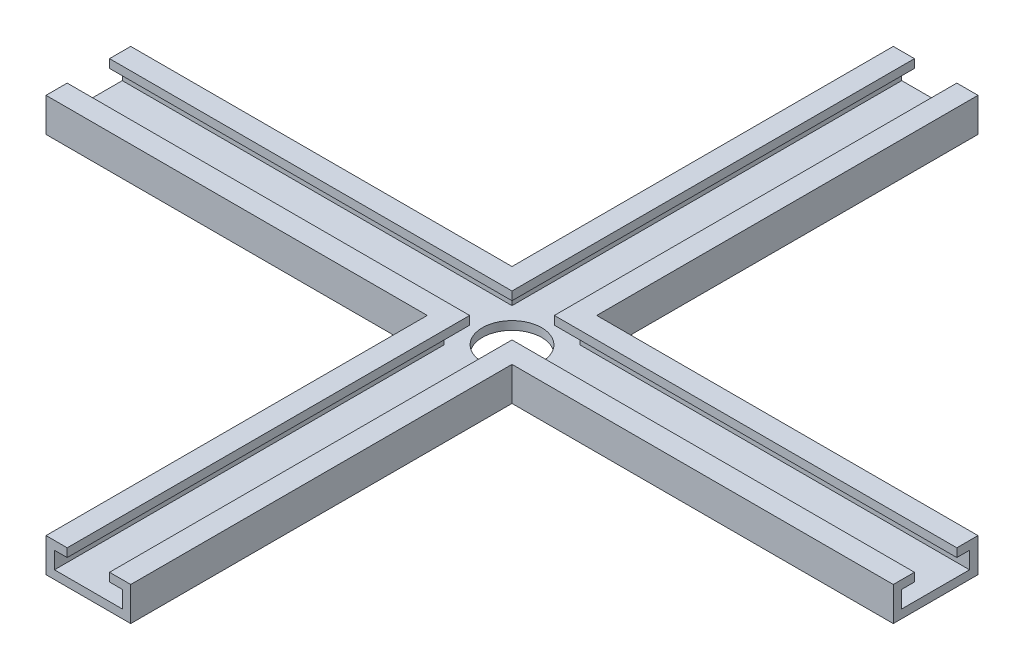
ISO-10303-21;
HEADER;
FILE_DESCRIPTION(('STEP AP214'),'2;1');
FILE_NAME('part.step','',(''),(''),'','','');
FILE_SCHEMA(('AUTOMOTIVE_DESIGN { 1 0 10303 214 1 1 1 1 }'));
ENDSEC;
DATA;
#1=APPLICATION_CONTEXT('core data for automotive mechanical design processes');
#2=APPLICATION_PROTOCOL_DEFINITION('international standard','automotive_design',2000,#1);
#3=PRODUCT_CONTEXT('',#1,'mechanical');
#4=PRODUCT('Part','Part','',(#3));
#5=PRODUCT_RELATED_PRODUCT_CATEGORY('part','',(#4));
#6=PRODUCT_DEFINITION_FORMATION('','',#4);
#7=PRODUCT_DEFINITION_CONTEXT('part definition',#1,'design');
#8=PRODUCT_DEFINITION('design','',#6,#7);
#9=PRODUCT_DEFINITION_SHAPE('','',#8);
#10=(LENGTH_UNIT() NAMED_UNIT(*) SI_UNIT(.MILLI.,.METRE.));
#11=(NAMED_UNIT(*) PLANE_ANGLE_UNIT() SI_UNIT($,.RADIAN.));
#12=(NAMED_UNIT(*) SI_UNIT($,.STERADIAN.) SOLID_ANGLE_UNIT());
#13=UNCERTAINTY_MEASURE_WITH_UNIT(LENGTH_MEASURE(1.E-05),#10,'distance_accuracy_value','');
#14=(GEOMETRIC_REPRESENTATION_CONTEXT(3) GLOBAL_UNCERTAINTY_ASSIGNED_CONTEXT((#13)) GLOBAL_UNIT_ASSIGNED_CONTEXT((#10,
#11,#12)) REPRESENTATION_CONTEXT('',''));
#15=CARTESIAN_POINT('',(0.,0.,0.));
#16=DIRECTION('',(0.,0.,1.));
#17=DIRECTION('',(1.,0.,0.));
#18=AXIS2_PLACEMENT_3D('',#15,#16,#17);
#19=CARTESIAN_POINT('',(-10.,8.,200.));
#20=DIRECTION('',(0.,-1.,0.));
#21=DIRECTION('',(0.,0.,-1.));
#22=AXIS2_PLACEMENT_3D('',#19,#20,#21);
#23=PLANE('',#22);
#24=DIRECTION('',(0.,0.,-1.));
#25=VECTOR('',#24,1.);
#26=CARTESIAN_POINT('',(-5.,8.,200.));
#27=LINE('',#26,#25);
#28=CARTESIAN_POINT('',(-5.,8.,200.));
#29=VERTEX_POINT('',#28);
#30=CARTESIAN_POINT('',(-5.,8.,105.));
#31=VERTEX_POINT('',#30);
#32=EDGE_CURVE('E397',#29,#31,#27,.T.);
#33=ORIENTED_EDGE('',*,*,#32,.T.);
#34=DIRECTION('',(-1.,0.,0.));
#35=VECTOR('',#34,1.);
#36=CARTESIAN_POINT('',(100.,8.,105.));
#37=LINE('',#36,#35);
#38=CARTESIAN_POINT('',(-100.,8.,105.));
#39=VERTEX_POINT('',#38);
#40=EDGE_CURVE('E432',#31,#39,#37,.T.);
#41=ORIENTED_EDGE('',*,*,#40,.T.);
#42=DIRECTION('',(0.,0.,1.));
#43=VECTOR('',#42,1.);
#44=CARTESIAN_POINT('',(-100.,8.,110.));
#45=LINE('',#44,#43);
#46=CARTESIAN_POINT('',(-100.,8.,110.));
#47=VERTEX_POINT('',#46);
#48=EDGE_CURVE('E482',#39,#47,#45,.T.);
#49=ORIENTED_EDGE('',*,*,#48,.T.);
#50=DIRECTION('',(-1.,0.,0.));
#51=VECTOR('',#50,1.);
#52=CARTESIAN_POINT('',(100.,8.,110.));
#53=LINE('',#52,#51);
#54=CARTESIAN_POINT('',(-10.,8.,110.));
#55=VERTEX_POINT('',#54);
#56=EDGE_CURVE('E517',#55,#47,#53,.T.);
#57=ORIENTED_EDGE('',*,*,#56,.F.);
#58=DIRECTION('',(0.,0.,-1.));
#59=VECTOR('',#58,1.);
#60=CARTESIAN_POINT('',(-10.,8.,200.));
#61=LINE('',#60,#59);
#62=CARTESIAN_POINT('',(-10.,8.,200.));
#63=VERTEX_POINT('',#62);
#64=EDGE_CURVE('E394',#63,#55,#61,.T.);
#65=ORIENTED_EDGE('',*,*,#64,.F.);
#66=DIRECTION('',(-1.,0.,0.));
#67=VECTOR('',#66,1.);
#68=CARTESIAN_POINT('',(-10.,8.,200.));
#69=LINE('',#68,#67);
#70=EDGE_CURVE('E349',#29,#63,#69,.T.);
#71=ORIENTED_EDGE('',*,*,#70,.F.);
#72=EDGE_LOOP('',(#33,#41,#49,#57,#65,#71));
#73=FACE_BOUND('',#72,.T.);
#74=ADVANCED_FACE('F31',(#73),#23,.F.);
#75=DIRECTION('',(-1.,0.,0.));
#76=VECTOR('',#75,1.);
#77=CARTESIAN_POINT('',(100.,8.,95.));
#78=LINE('',#77,#76);
#79=CARTESIAN_POINT('',(-5.,8.,95.));
#80=VERTEX_POINT('',#79);
#81=CARTESIAN_POINT('',(-100.,8.,95.));
#82=VERTEX_POINT('',#81);
#83=EDGE_CURVE('E303',#80,#82,#78,.T.);
#84=ORIENTED_EDGE('',*,*,#83,.F.);
#85=CARTESIAN_POINT('',(-5.,8.,0.));
#86=VERTEX_POINT('',#85);
#87=EDGE_CURVE('E396',#80,#86,#27,.T.);
#88=ORIENTED_EDGE('',*,*,#87,.T.);
#89=DIRECTION('',(-1.,0.,0.));
#90=VECTOR('',#89,1.);
#91=CARTESIAN_POINT('',(-10.,8.,0.));
#92=LINE('',#91,#90);
#93=CARTESIAN_POINT('',(-10.,8.,0.));
#94=VERTEX_POINT('',#93);
#95=EDGE_CURVE('E378',#86,#94,#92,.T.);
#96=ORIENTED_EDGE('',*,*,#95,.T.);
#97=CARTESIAN_POINT('',(-10.,8.,90.));
#98=VERTEX_POINT('',#97);
#99=EDGE_CURVE('E393',#98,#94,#61,.T.);
#100=ORIENTED_EDGE('',*,*,#99,.F.);
#101=DIRECTION('',(-1.,0.,0.));
#102=VECTOR('',#101,1.);
#103=CARTESIAN_POINT('',(100.,8.,90.));
#104=LINE('',#103,#102);
#105=CARTESIAN_POINT('',(-100.,8.,90.));
#106=VERTEX_POINT('',#105);
#107=EDGE_CURVE('E307',#98,#106,#104,.T.);
#108=ORIENTED_EDGE('',*,*,#107,.T.);
#109=DIRECTION('',(0.,0.,1.));
#110=VECTOR('',#109,1.);
#111=CARTESIAN_POINT('',(-100.,8.,90.));
#112=LINE('',#111,#110);
#113=EDGE_CURVE('E527',#106,#82,#112,.T.);
#114=ORIENTED_EDGE('',*,*,#113,.T.);
#115=EDGE_LOOP('',(#84,#88,#96,#100,#108,#114));
#116=FACE_BOUND('',#115,.T.);
#117=ADVANCED_FACE('F552',(#116),#23,.F.);
#118=CARTESIAN_POINT('',(100.,6.,95.));
#119=DIRECTION('',(0.,0.,-1.));
#120=DIRECTION('',(-1.,0.,0.));
#121=AXIS2_PLACEMENT_3D('',#118,#119,#120);
#122=PLANE('',#121);
#123=DIRECTION('',(-1.,0.,0.));
#124=VECTOR('',#123,1.);
#125=CARTESIAN_POINT('',(100.,6.,95.));
#126=LINE('',#125,#124);
#127=CARTESIAN_POINT('',(-5.,6.,95.));
#128=VERTEX_POINT('',#127);
#129=CARTESIAN_POINT('',(-100.,6.,95.));
#130=VERTEX_POINT('',#129);
#131=EDGE_CURVE('E294',#128,#130,#126,.T.);
#132=ORIENTED_EDGE('',*,*,#131,.F.);
#133=DIRECTION('',(0.,1.,0.));
#134=VECTOR('',#133,1.);
#135=CARTESIAN_POINT('',(-5.,6.,95.));
#136=LINE('',#135,#134);
#137=EDGE_CURVE('E550',#128,#80,#136,.T.);
#138=ORIENTED_EDGE('',*,*,#137,.T.);
#139=ORIENTED_EDGE('',*,*,#83,.T.);
#140=DIRECTION('',(0.,-1.,0.));
#141=VECTOR('',#140,1.);
#142=CARTESIAN_POINT('',(-100.,6.,95.));
#143=LINE('',#142,#141);
#144=EDGE_CURVE('E530',#82,#130,#143,.T.);
#145=ORIENTED_EDGE('',*,*,#144,.T.);
#146=EDGE_LOOP('',(#132,#138,#139,#145));
#147=FACE_BOUND('',#146,.T.);
#148=ADVANCED_FACE('F548',(#147),#122,.F.);
#149=CARTESIAN_POINT('',(100.,2.,92.));
#150=DIRECTION('',(0.,0.,-1.));
#151=DIRECTION('',(-1.,0.,0.));
#152=AXIS2_PLACEMENT_3D('',#149,#150,#151);
#153=PLANE('',#152);
#154=DIRECTION('',(-1.,0.,0.));
#155=VECTOR('',#154,1.);
#156=CARTESIAN_POINT('',(100.,2.,92.));
#157=LINE('',#156,#155);
#158=CARTESIAN_POINT('',(-7.99999999999999,2.,92.));
#159=VERTEX_POINT('',#158);
#160=CARTESIAN_POINT('',(-100.,2.,92.));
#161=VERTEX_POINT('',#160);
#162=EDGE_CURVE('E445',#159,#161,#157,.T.);
#163=ORIENTED_EDGE('',*,*,#162,.F.);
#164=DIRECTION('',(0.,1.,0.));
#165=VECTOR('',#164,1.);
#166=CARTESIAN_POINT('',(-8.00000000000001,2.,92.));
#167=LINE('',#166,#165);
#168=CARTESIAN_POINT('',(-8.,6.,92.));
#169=VERTEX_POINT('',#168);
#170=EDGE_CURVE('E497',#159,#169,#167,.T.);
#171=ORIENTED_EDGE('',*,*,#170,.T.);
#172=DIRECTION('',(-1.,0.,0.));
#173=VECTOR('',#172,1.);
#174=CARTESIAN_POINT('',(100.,6.,92.));
#175=LINE('',#174,#173);
#176=CARTESIAN_POINT('',(-100.,6.,92.));
#177=VERTEX_POINT('',#176);
#178=EDGE_CURVE('E295',#169,#177,#175,.T.);
#179=ORIENTED_EDGE('',*,*,#178,.T.);
#180=DIRECTION('',(0.,-1.,0.));
#181=VECTOR('',#180,1.);
#182=CARTESIAN_POINT('',(-100.,2.,92.));
#183=LINE('',#182,#181);
#184=EDGE_CURVE('E469',#177,#161,#183,.T.);
#185=ORIENTED_EDGE('',*,*,#184,.T.);
#186=EDGE_LOOP('',(#163,#171,#179,#185));
#187=FACE_BOUND('',#186,.T.);
#188=ADVANCED_FACE('F536',(#187),#153,.F.);
#189=CARTESIAN_POINT('',(100.,2.,108.));
#190=DIRECTION('',(0.,0.,1.));
#191=DIRECTION('',(1.,0.,0.));
#192=AXIS2_PLACEMENT_3D('',#189,#190,#191);
#193=PLANE('',#192);
#194=DIRECTION('',(-1.,0.,0.));
#195=VECTOR('',#194,1.);
#196=CARTESIAN_POINT('',(100.,6.,108.));
#197=LINE('',#196,#195);
#198=CARTESIAN_POINT('',(-8.,6.,108.));
#199=VERTEX_POINT('',#198);
#200=CARTESIAN_POINT('',(-100.,6.,108.));
#201=VERTEX_POINT('',#200);
#202=EDGE_CURVE('E439',#199,#201,#197,.T.);
#203=ORIENTED_EDGE('',*,*,#202,.F.);
#204=DIRECTION('',(0.,-1.,0.));
#205=VECTOR('',#204,1.);
#206=CARTESIAN_POINT('',(-8.00000000000001,2.,108.));
#207=LINE('',#206,#205);
#208=CARTESIAN_POINT('',(-8.,2.,108.));
#209=VERTEX_POINT('',#208);
#210=EDGE_CURVE('E289',#199,#209,#207,.T.);
#211=ORIENTED_EDGE('',*,*,#210,.T.);
#212=DIRECTION('',(-1.,0.,0.));
#213=VECTOR('',#212,1.);
#214=CARTESIAN_POINT('',(100.,2.,108.));
#215=LINE('',#214,#213);
#216=CARTESIAN_POINT('',(-100.,2.,108.));
#217=VERTEX_POINT('',#216);
#218=EDGE_CURVE('E442',#209,#217,#215,.T.);
#219=ORIENTED_EDGE('',*,*,#218,.T.);
#220=DIRECTION('',(0.,1.,0.));
#221=VECTOR('',#220,1.);
#222=CARTESIAN_POINT('',(-100.,2.,108.));
#223=LINE('',#222,#221);
#224=EDGE_CURVE('E458',#217,#201,#223,.T.);
#225=ORIENTED_EDGE('',*,*,#224,.T.);
#226=EDGE_LOOP('',(#203,#211,#219,#225));
#227=FACE_BOUND('',#226,.T.);
#228=ADVANCED_FACE('F456',(#227),#193,.F.);
#229=CARTESIAN_POINT('',(100.,6.,105.));
#230=DIRECTION('',(0.,0.,1.));
#231=DIRECTION('',(1.,0.,0.));
#232=AXIS2_PLACEMENT_3D('',#229,#230,#231);
#233=PLANE('',#232);
#234=ORIENTED_EDGE('',*,*,#40,.F.);
#235=DIRECTION('',(0.,-1.,0.));
#236=VECTOR('',#235,1.);
#237=CARTESIAN_POINT('',(-5.,6.,105.));
#238=LINE('',#237,#236);
#239=CARTESIAN_POINT('',(-5.,6.,105.));
#240=VERTEX_POINT('',#239);
#241=EDGE_CURVE('E11',#31,#240,#238,.T.);
#242=ORIENTED_EDGE('',*,*,#241,.T.);
#243=DIRECTION('',(-1.,0.,0.));
#244=VECTOR('',#243,1.);
#245=CARTESIAN_POINT('',(100.,6.,105.));
#246=LINE('',#245,#244);
#247=CARTESIAN_POINT('',(-100.,6.,105.));
#248=VERTEX_POINT('',#247);
#249=EDGE_CURVE('E431',#240,#248,#246,.T.);
#250=ORIENTED_EDGE('',*,*,#249,.T.);
#251=DIRECTION('',(0.,1.,0.));
#252=VECTOR('',#251,1.);
#253=CARTESIAN_POINT('',(-100.,6.,105.));
#254=LINE('',#253,#252);
#255=EDGE_CURVE('E477',#248,#39,#254,.T.);
#256=ORIENTED_EDGE('',*,*,#255,.T.);
#257=EDGE_LOOP('',(#234,#242,#250,#256));
#258=FACE_BOUND('',#257,.T.);
#259=ADVANCED_FACE('F570',(#258),#233,.F.);
#260=CARTESIAN_POINT('',(100.,8.,105.));
#261=VERTEX_POINT('',#260);
#262=CARTESIAN_POINT('',(5.,8.,105.));
#263=VERTEX_POINT('',#262);
#264=EDGE_CURVE('E422',#261,#263,#37,.T.);
#265=ORIENTED_EDGE('',*,*,#264,.T.);
#266=DIRECTION('',(0.,0.,-1.));
#267=VECTOR('',#266,1.);
#268=CARTESIAN_POINT('',(5.,8.,200.));
#269=LINE('',#268,#267);
#270=CARTESIAN_POINT('',(5.,8.,200.));
#271=VERTEX_POINT('',#270);
#272=EDGE_CURVE('E54',#271,#263,#269,.T.);
#273=ORIENTED_EDGE('',*,*,#272,.F.);
#274=DIRECTION('',(-1.,0.,0.));
#275=VECTOR('',#274,1.);
#276=CARTESIAN_POINT('',(10.,8.,200.));
#277=LINE('',#276,#275);
#278=CARTESIAN_POINT('',(10.,8.,200.));
#279=VERTEX_POINT('',#278);
#280=EDGE_CURVE('E332',#279,#271,#277,.T.);
#281=ORIENTED_EDGE('',*,*,#280,.F.);
#282=DIRECTION('',(0.,0.,-1.));
#283=VECTOR('',#282,1.);
#284=CARTESIAN_POINT('',(10.,8.,200.));
#285=LINE('',#284,#283);
#286=CARTESIAN_POINT('',(9.99999999999999,8.,110.));
#287=VERTEX_POINT('',#286);
#288=EDGE_CURVE('E414',#279,#287,#285,.T.);
#289=ORIENTED_EDGE('',*,*,#288,.T.);
#290=CARTESIAN_POINT('',(100.,8.,110.));
#291=VERTEX_POINT('',#290);
#292=EDGE_CURVE('E435',#291,#287,#53,.T.);
#293=ORIENTED_EDGE('',*,*,#292,.F.);
#294=DIRECTION('',(0.,0.,1.));
#295=VECTOR('',#294,1.);
#296=CARTESIAN_POINT('',(100.,8.,110.));
#297=LINE('',#296,#295);
#298=EDGE_CURVE('E430',#261,#291,#297,.T.);
#299=ORIENTED_EDGE('',*,*,#298,.F.);
#300=EDGE_LOOP('',(#265,#273,#281,#289,#293,#299));
#301=FACE_BOUND('',#300,.T.);
#302=ADVANCED_FACE('F428',(#301),#23,.F.);
#303=CARTESIAN_POINT('',(10.,0.,200.));
#304=DIRECTION('',(-1.,0.,0.));
#305=DIRECTION('',(0.,0.,1.));
#306=AXIS2_PLACEMENT_3D('',#303,#304,#305);
#307=PLANE('',#306);
#308=DIRECTION('',(0.,-1.,0.));
#309=VECTOR('',#308,1.);
#310=CARTESIAN_POINT('',(10.,0.,110.));
#311=LINE('',#310,#309);
#312=CARTESIAN_POINT('',(9.99999999999999,0.,110.));
#313=VERTEX_POINT('',#312);
#314=EDGE_CURVE('E326',#287,#313,#311,.T.);
#315=ORIENTED_EDGE('',*,*,#314,.F.);
#316=ORIENTED_EDGE('',*,*,#288,.F.);
#317=DIRECTION('',(0.,1.,0.));
#318=VECTOR('',#317,1.);
#319=CARTESIAN_POINT('',(10.,0.,200.));
#320=LINE('',#319,#318);
#321=CARTESIAN_POINT('',(10.,0.,200.));
#322=VERTEX_POINT('',#321);
#323=EDGE_CURVE('E329',#322,#279,#320,.T.);
#324=ORIENTED_EDGE('',*,*,#323,.F.);
#325=DIRECTION('',(0.,0.,-1.));
#326=VECTOR('',#325,1.);
#327=CARTESIAN_POINT('',(10.,0.,200.));
#328=LINE('',#327,#326);
#329=EDGE_CURVE('E386',#322,#313,#328,.T.);
#330=ORIENTED_EDGE('',*,*,#329,.T.);
#331=EDGE_LOOP('',(#315,#316,#324,#330));
#332=FACE_BOUND('',#331,.T.);
#333=ADVANCED_FACE('F33',(#332),#307,.F.);
#334=DIRECTION('',(0.,1.,0.));
#335=VECTOR('',#334,1.);
#336=CARTESIAN_POINT('',(10.,0.,90.));
#337=LINE('',#336,#335);
#338=CARTESIAN_POINT('',(9.99999999999999,0.,90.));
#339=VERTEX_POINT('',#338);
#340=CARTESIAN_POINT('',(9.99999999999999,8.,90.));
#341=VERTEX_POINT('',#340);
#342=EDGE_CURVE('E321',#339,#341,#337,.T.);
#343=ORIENTED_EDGE('',*,*,#342,.F.);
#344=CARTESIAN_POINT('',(10.,0.,0.));
#345=VERTEX_POINT('',#344);
#346=EDGE_CURVE('E355',#339,#345,#328,.T.);
#347=ORIENTED_EDGE('',*,*,#346,.T.);
#348=DIRECTION('',(0.,1.,0.));
#349=VECTOR('',#348,1.);
#350=CARTESIAN_POINT('',(10.,0.,0.));
#351=LINE('',#350,#349);
#352=CARTESIAN_POINT('',(10.,8.,0.));
#353=VERTEX_POINT('',#352);
#354=EDGE_CURVE('E328',#345,#353,#351,.T.);
#355=ORIENTED_EDGE('',*,*,#354,.T.);
#356=EDGE_CURVE('E413',#341,#353,#285,.T.);
#357=ORIENTED_EDGE('',*,*,#356,.F.);
#358=EDGE_LOOP('',(#343,#347,#355,#357));
#359=FACE_BOUND('',#358,.T.);
#360=ADVANCED_FACE('F643',(#359),#307,.F.);
#361=CARTESIAN_POINT('',(5.,8.,200.));
#362=DIRECTION('',(1.,0.,0.));
#363=DIRECTION('',(0.,0.,-1.));
#364=AXIS2_PLACEMENT_3D('',#361,#362,#363);
#365=PLANE('',#364);
#366=ORIENTED_EDGE('',*,*,#272,.T.);
#367=DIRECTION('',(0.,1.,0.));
#368=VECTOR('',#367,1.);
#369=CARTESIAN_POINT('',(5.,6.,105.));
#370=LINE('',#369,#368);
#371=CARTESIAN_POINT('',(5.,6.,105.));
#372=VERTEX_POINT('',#371);
#373=EDGE_CURVE('E39',#372,#263,#370,.T.);
#374=ORIENTED_EDGE('',*,*,#373,.F.);
#375=DIRECTION('',(0.,0.,-1.));
#376=VECTOR('',#375,1.);
#377=CARTESIAN_POINT('',(5.,6.,200.));
#378=LINE('',#377,#376);
#379=CARTESIAN_POINT('',(5.,6.,200.));
#380=VERTEX_POINT('',#379);
#381=EDGE_CURVE('E409',#380,#372,#378,.T.);
#382=ORIENTED_EDGE('',*,*,#381,.F.);
#383=DIRECTION('',(0.,-1.,0.));
#384=VECTOR('',#383,1.);
#385=CARTESIAN_POINT('',(5.,8.,200.));
#386=LINE('',#385,#384);
#387=EDGE_CURVE('E335',#271,#380,#386,.T.);
#388=ORIENTED_EDGE('',*,*,#387,.F.);
#389=EDGE_LOOP('',(#366,#374,#382,#388));
#390=FACE_BOUND('',#389,.T.);
#391=ADVANCED_FACE('F641',(#390),#365,.F.);
#392=CARTESIAN_POINT('',(5.,6.,95.));
#393=VERTEX_POINT('',#392);
#394=CARTESIAN_POINT('',(5.,6.,0.));
#395=VERTEX_POINT('',#394);
#396=EDGE_CURVE('E408',#393,#395,#378,.T.);
#397=ORIENTED_EDGE('',*,*,#396,.F.);
#398=DIRECTION('',(0.,-1.,0.));
#399=VECTOR('',#398,1.);
#400=CARTESIAN_POINT('',(5.,6.,95.));
#401=LINE('',#400,#399);
#402=CARTESIAN_POINT('',(5.,8.,95.));
#403=VERTEX_POINT('',#402);
#404=EDGE_CURVE('E584',#403,#393,#401,.T.);
#405=ORIENTED_EDGE('',*,*,#404,.F.);
#406=CARTESIAN_POINT('',(5.,8.,0.));
#407=VERTEX_POINT('',#406);
#408=EDGE_CURVE('E411',#403,#407,#269,.T.);
#409=ORIENTED_EDGE('',*,*,#408,.T.);
#410=DIRECTION('',(0.,-1.,0.));
#411=VECTOR('',#410,1.);
#412=CARTESIAN_POINT('',(5.,8.,0.));
#413=LINE('',#412,#411);
#414=EDGE_CURVE('E361',#407,#395,#413,.T.);
#415=ORIENTED_EDGE('',*,*,#414,.T.);
#416=EDGE_LOOP('',(#397,#405,#409,#415));
#417=FACE_BOUND('',#416,.T.);
#418=ADVANCED_FACE('F639',(#417),#365,.F.);
#419=CARTESIAN_POINT('',(8.,6.,200.));
#420=DIRECTION('',(0.,1.,0.));
#421=DIRECTION('',(0.,0.,1.));
#422=AXIS2_PLACEMENT_3D('',#419,#420,#421);
#423=PLANE('',#422);
#424=ORIENTED_EDGE('',*,*,#381,.T.);
#425=CARTESIAN_POINT('',(100.,6.,105.));
#426=VERTEX_POINT('',#425);
#427=EDGE_CURVE('E425',#426,#372,#246,.T.);
#428=ORIENTED_EDGE('',*,*,#427,.F.);
#429=DIRECTION('',(0.,0.,-1.));
#430=VECTOR('',#429,1.);
#431=CARTESIAN_POINT('',(100.,6.,108.));
#432=LINE('',#431,#430);
#433=CARTESIAN_POINT('',(100.,6.,108.));
#434=VERTEX_POINT('',#433);
#435=EDGE_CURVE('E512',#434,#426,#432,.T.);
#436=ORIENTED_EDGE('',*,*,#435,.F.);
#437=CARTESIAN_POINT('',(8.,6.,108.));
#438=VERTEX_POINT('',#437);
#439=EDGE_CURVE('E440',#434,#438,#197,.T.);
#440=ORIENTED_EDGE('',*,*,#439,.T.);
#441=DIRECTION('',(0.,0.,-1.));
#442=VECTOR('',#441,1.);
#443=CARTESIAN_POINT('',(8.,6.,200.));
#444=LINE('',#443,#442);
#445=CARTESIAN_POINT('',(8.,6.,200.));
#446=VERTEX_POINT('',#445);
#447=EDGE_CURVE('E279',#446,#438,#444,.T.);
#448=ORIENTED_EDGE('',*,*,#447,.F.);
#449=DIRECTION('',(1.,0.,0.));
#450=VECTOR('',#449,1.);
#451=CARTESIAN_POINT('',(8.,6.,200.));
#452=LINE('',#451,#450);
#453=EDGE_CURVE('E337',#380,#446,#452,.T.);
#454=ORIENTED_EDGE('',*,*,#453,.F.);
#455=EDGE_LOOP('',(#424,#428,#436,#440,#448,#454));
#456=FACE_BOUND('',#455,.T.);
#457=ADVANCED_FACE('F636',(#456),#423,.F.);
#458=CARTESIAN_POINT('',(8.,2.,200.));
#459=DIRECTION('',(1.,0.,0.));
#460=DIRECTION('',(0.,0.,-1.));
#461=AXIS2_PLACEMENT_3D('',#458,#459,#460);
#462=PLANE('',#461);
#463=ORIENTED_EDGE('',*,*,#447,.T.);
#464=DIRECTION('',(0.,1.,0.));
#465=VECTOR('',#464,1.);
#466=CARTESIAN_POINT('',(8.00000000000001,2.,108.));
#467=LINE('',#466,#465);
#468=CARTESIAN_POINT('',(8.,2.,108.));
#469=VERTEX_POINT('',#468);
#470=EDGE_CURVE('E290',#469,#438,#467,.T.);
#471=ORIENTED_EDGE('',*,*,#470,.F.);
#472=DIRECTION('',(0.,0.,-1.));
#473=VECTOR('',#472,1.);
#474=CARTESIAN_POINT('',(8.,2.,200.));
#475=LINE('',#474,#473);
#476=CARTESIAN_POINT('',(8.,2.,200.));
#477=VERTEX_POINT('',#476);
#478=EDGE_CURVE('E280',#477,#469,#475,.T.);
#479=ORIENTED_EDGE('',*,*,#478,.F.);
#480=DIRECTION('',(0.,-1.,0.));
#481=VECTOR('',#480,1.);
#482=CARTESIAN_POINT('',(8.,2.,200.));
#483=LINE('',#482,#481);
#484=EDGE_CURVE('E339',#446,#477,#483,.T.);
#485=ORIENTED_EDGE('',*,*,#484,.F.);
#486=EDGE_LOOP('',(#463,#471,#479,#485));
#487=FACE_BOUND('',#486,.T.);
#488=ADVANCED_FACE('F633',(#487),#462,.F.);
#489=CARTESIAN_POINT('',(8.,2.,92.));
#490=VERTEX_POINT('',#489);
#491=CARTESIAN_POINT('',(8.,2.,0.));
#492=VERTEX_POINT('',#491);
#493=EDGE_CURVE('E285',#490,#492,#475,.T.);
#494=ORIENTED_EDGE('',*,*,#493,.F.);
#495=DIRECTION('',(0.,-1.,0.));
#496=VECTOR('',#495,1.);
#497=CARTESIAN_POINT('',(8.00000000000001,2.,92.));
#498=LINE('',#497,#496);
#499=CARTESIAN_POINT('',(8.,6.,92.));
#500=VERTEX_POINT('',#499);
#501=EDGE_CURVE('E283',#500,#490,#498,.T.);
#502=ORIENTED_EDGE('',*,*,#501,.F.);
#503=CARTESIAN_POINT('',(8.,6.,0.));
#504=VERTEX_POINT('',#503);
#505=EDGE_CURVE('E266',#500,#504,#444,.T.);
#506=ORIENTED_EDGE('',*,*,#505,.T.);
#507=DIRECTION('',(0.,-1.,0.));
#508=VECTOR('',#507,1.);
#509=CARTESIAN_POINT('',(8.,2.,0.));
#510=LINE('',#509,#508);
#511=EDGE_CURVE('E365',#504,#492,#510,.T.);
#512=ORIENTED_EDGE('',*,*,#511,.T.);
#513=EDGE_LOOP('',(#494,#502,#506,#512));
#514=FACE_BOUND('',#513,.T.);
#515=ADVANCED_FACE('F284',(#514),#462,.F.);
#516=CARTESIAN_POINT('',(0.,2.,200.));
#517=DIRECTION('',(0.,-1.,0.));
#518=DIRECTION('',(0.,0.,-1.));
#519=AXIS2_PLACEMENT_3D('',#516,#517,#518);
#520=PLANE('',#519);
#521=CARTESIAN_POINT('',(0.,2.,100.));
#522=DIRECTION('',(0.,-1.,0.));
#523=DIRECTION('',(0.,0.,-1.));
#524=AXIS2_PLACEMENT_3D('',#521,#522,#523);
#525=CIRCLE('',#524,7.);
#526=CARTESIAN_POINT('',(0.,2.,93.));
#527=VERTEX_POINT('',#526);
#528=EDGE_CURVE('E587',#527,#527,#525,.T.);
#529=ORIENTED_EDGE('',*,*,#528,.T.);
#530=EDGE_LOOP('',(#529));
#531=FACE_BOUND('',#530,.T.);
#532=CARTESIAN_POINT('',(100.,2.,92.));
#533=VERTEX_POINT('',#532);
#534=EDGE_CURVE('E299',#533,#490,#157,.T.);
#535=ORIENTED_EDGE('',*,*,#534,.T.);
#536=ORIENTED_EDGE('',*,*,#493,.T.);
#537=DIRECTION('',(-1.,0.,0.));
#538=VECTOR('',#537,1.);
#539=CARTESIAN_POINT('',(0.,2.,0.));
#540=LINE('',#539,#538);
#541=CARTESIAN_POINT('',(-8.,2.,0.));
#542=VERTEX_POINT('',#541);
#543=EDGE_CURVE('E367',#492,#542,#540,.T.);
#544=ORIENTED_EDGE('',*,*,#543,.T.);
#545=DIRECTION('',(0.,0.,-1.));
#546=VECTOR('',#545,1.);
#547=CARTESIAN_POINT('',(-8.,2.,200.));
#548=LINE('',#547,#546);
#549=EDGE_CURVE('E46',#159,#542,#548,.T.);
#550=ORIENTED_EDGE('',*,*,#549,.F.);
#551=ORIENTED_EDGE('',*,*,#162,.T.);
#552=DIRECTION('',(0.,0.,1.));
#553=VECTOR('',#552,1.);
#554=CARTESIAN_POINT('',(-100.,2.,100.));
#555=LINE('',#554,#553);
#556=EDGE_CURVE('E463',#161,#217,#555,.T.);
#557=ORIENTED_EDGE('',*,*,#556,.T.);
#558=ORIENTED_EDGE('',*,*,#218,.F.);
#559=CARTESIAN_POINT('',(-8.,2.,200.));
#560=VERTEX_POINT('',#559);
#561=EDGE_CURVE('E405',#560,#209,#548,.T.);
#562=ORIENTED_EDGE('',*,*,#561,.F.);
#563=DIRECTION('',(-1.,0.,0.));
#564=VECTOR('',#563,1.);
#565=CARTESIAN_POINT('',(0.,2.,200.));
#566=LINE('',#565,#564);
#567=EDGE_CURVE('E341',#477,#560,#566,.T.);
#568=ORIENTED_EDGE('',*,*,#567,.F.);
#569=ORIENTED_EDGE('',*,*,#478,.T.);
#570=CARTESIAN_POINT('',(100.,2.,108.));
#571=VERTEX_POINT('',#570);
#572=EDGE_CURVE('E443',#571,#469,#215,.T.);
#573=ORIENTED_EDGE('',*,*,#572,.F.);
#574=DIRECTION('',(0.,0.,1.));
#575=VECTOR('',#574,1.);
#576=CARTESIAN_POINT('',(100.,2.,100.));
#577=LINE('',#576,#575);
#578=EDGE_CURVE('E508',#533,#571,#577,.T.);
#579=ORIENTED_EDGE('',*,*,#578,.F.);
#580=EDGE_LOOP('',(#535,#536,#544,#550,#551,#557,#558,#562,#568,#569,#573,#579));
#581=FACE_BOUND('',#580,.T.);
#582=ADVANCED_FACE('F464',(#531,#581),#520,.F.);
#583=CARTESIAN_POINT('',(-8.,2.,200.));
#584=DIRECTION('',(-1.,0.,0.));
#585=DIRECTION('',(0.,0.,1.));
#586=AXIS2_PLACEMENT_3D('',#583,#584,#585);
#587=PLANE('',#586);
#588=ORIENTED_EDGE('',*,*,#561,.T.);
#589=ORIENTED_EDGE('',*,*,#210,.F.);
#590=DIRECTION('',(0.,0.,-1.));
#591=VECTOR('',#590,1.);
#592=CARTESIAN_POINT('',(-8.,6.,200.));
#593=LINE('',#592,#591);
#594=CARTESIAN_POINT('',(-8.,6.,200.));
#595=VERTEX_POINT('',#594);
#596=EDGE_CURVE('E403',#595,#199,#593,.T.);
#597=ORIENTED_EDGE('',*,*,#596,.F.);
#598=DIRECTION('',(0.,1.,0.));
#599=VECTOR('',#598,1.);
#600=CARTESIAN_POINT('',(-8.,2.,200.));
#601=LINE('',#600,#599);
#602=EDGE_CURVE('E343',#560,#595,#601,.T.);
#603=ORIENTED_EDGE('',*,*,#602,.F.);
#604=EDGE_LOOP('',(#588,#589,#597,#603));
#605=FACE_BOUND('',#604,.T.);
#606=ADVANCED_FACE('F580',(#605),#587,.F.);
#607=CARTESIAN_POINT('',(-8.,6.,0.));
#608=VERTEX_POINT('',#607);
#609=EDGE_CURVE('E402',#169,#608,#593,.T.);
#610=ORIENTED_EDGE('',*,*,#609,.F.);
#611=ORIENTED_EDGE('',*,*,#170,.F.);
#612=ORIENTED_EDGE('',*,*,#549,.T.);
#613=DIRECTION('',(0.,1.,0.));
#614=VECTOR('',#613,1.);
#615=CARTESIAN_POINT('',(-8.,2.,0.));
#616=LINE('',#615,#614);
#617=EDGE_CURVE('E369',#542,#608,#616,.T.);
#618=ORIENTED_EDGE('',*,*,#617,.T.);
#619=EDGE_LOOP('',(#610,#611,#612,#618));
#620=FACE_BOUND('',#619,.T.);
#621=ADVANCED_FACE('F628',(#620),#587,.F.);
#622=CARTESIAN_POINT('',(-8.,6.,200.));
#623=DIRECTION('',(0.,1.,0.));
#624=DIRECTION('',(0.,0.,1.));
#625=AXIS2_PLACEMENT_3D('',#622,#623,#624);
#626=PLANE('',#625);
#627=ORIENTED_EDGE('',*,*,#596,.T.);
#628=ORIENTED_EDGE('',*,*,#202,.T.);
#629=DIRECTION('',(0.,0.,-1.));
#630=VECTOR('',#629,1.);
#631=CARTESIAN_POINT('',(-100.,6.,108.));
#632=LINE('',#631,#630);
#633=EDGE_CURVE('E475',#201,#248,#632,.T.);
#634=ORIENTED_EDGE('',*,*,#633,.T.);
#635=ORIENTED_EDGE('',*,*,#249,.F.);
#636=DIRECTION('',(0.,0.,-1.));
#637=VECTOR('',#636,1.);
#638=CARTESIAN_POINT('',(-5.,6.,200.));
#639=LINE('',#638,#637);
#640=CARTESIAN_POINT('',(-5.,6.,200.));
#641=VERTEX_POINT('',#640);
#642=EDGE_CURVE('E400',#641,#240,#639,.T.);
#643=ORIENTED_EDGE('',*,*,#642,.F.);
#644=DIRECTION('',(1.,0.,0.));
#645=VECTOR('',#644,1.);
#646=CARTESIAN_POINT('',(-8.,6.,200.));
#647=LINE('',#646,#645);
#648=EDGE_CURVE('E345',#595,#641,#647,.T.);
#649=ORIENTED_EDGE('',*,*,#648,.F.);
#650=EDGE_LOOP('',(#627,#628,#634,#635,#643,#649));
#651=FACE_BOUND('',#650,.T.);
#652=ADVANCED_FACE('F575',(#651),#626,.F.);
#653=CARTESIAN_POINT('',(-5.,6.,0.));
#654=VERTEX_POINT('',#653);
#655=EDGE_CURVE('E399',#128,#654,#639,.T.);
#656=ORIENTED_EDGE('',*,*,#655,.F.);
#657=ORIENTED_EDGE('',*,*,#131,.T.);
#658=DIRECTION('',(0.,0.,-1.));
#659=VECTOR('',#658,1.);
#660=CARTESIAN_POINT('',(-100.,6.,92.));
#661=LINE('',#660,#659);
#662=EDGE_CURVE('E533',#130,#177,#661,.T.);
#663=ORIENTED_EDGE('',*,*,#662,.T.);
#664=ORIENTED_EDGE('',*,*,#178,.F.);
#665=ORIENTED_EDGE('',*,*,#609,.T.);
#666=DIRECTION('',(1.,0.,0.));
#667=VECTOR('',#666,1.);
#668=CARTESIAN_POINT('',(-8.,6.,0.));
#669=LINE('',#668,#667);
#670=EDGE_CURVE('E372',#608,#654,#669,.T.);
#671=ORIENTED_EDGE('',*,*,#670,.T.);
#672=EDGE_LOOP('',(#656,#657,#663,#664,#665,#671));
#673=FACE_BOUND('',#672,.T.);
#674=ADVANCED_FACE('F543',(#673),#626,.F.);
#675=CARTESIAN_POINT('',(100.,6.,95.));
#676=VERTEX_POINT('',#675);
#677=EDGE_CURVE('E297',#676,#393,#126,.T.);
#678=ORIENTED_EDGE('',*,*,#677,.T.);
#679=ORIENTED_EDGE('',*,*,#396,.T.);
#680=DIRECTION('',(1.,0.,0.));
#681=VECTOR('',#680,1.);
#682=CARTESIAN_POINT('',(8.,6.,0.));
#683=LINE('',#682,#681);
#684=EDGE_CURVE('E275',#395,#504,#683,.T.);
#685=ORIENTED_EDGE('',*,*,#684,.T.);
#686=ORIENTED_EDGE('',*,*,#505,.F.);
#687=CARTESIAN_POINT('',(100.,6.,92.));
#688=VERTEX_POINT('',#687);
#689=EDGE_CURVE('E272',#688,#500,#175,.T.);
#690=ORIENTED_EDGE('',*,*,#689,.F.);
#691=DIRECTION('',(0.,0.,-1.));
#692=VECTOR('',#691,1.);
#693=CARTESIAN_POINT('',(100.,6.,92.));
#694=LINE('',#693,#692);
#695=EDGE_CURVE('E505',#676,#688,#694,.T.);
#696=ORIENTED_EDGE('',*,*,#695,.F.);
#697=EDGE_LOOP('',(#678,#679,#685,#686,#690,#696));
#698=FACE_BOUND('',#697,.T.);
#699=ADVANCED_FACE('F269',(#698),#626,.F.);
#700=CARTESIAN_POINT('',(-5.,8.,200.));
#701=DIRECTION('',(-1.,0.,0.));
#702=DIRECTION('',(0.,0.,1.));
#703=AXIS2_PLACEMENT_3D('',#700,#701,#702);
#704=PLANE('',#703);
#705=ORIENTED_EDGE('',*,*,#642,.T.);
#706=ORIENTED_EDGE('',*,*,#241,.F.);
#707=ORIENTED_EDGE('',*,*,#32,.F.);
#708=DIRECTION('',(0.,1.,0.));
#709=VECTOR('',#708,1.);
#710=CARTESIAN_POINT('',(-5.,8.,200.));
#711=LINE('',#710,#709);
#712=EDGE_CURVE('E347',#641,#29,#711,.T.);
#713=ORIENTED_EDGE('',*,*,#712,.F.);
#714=EDGE_LOOP('',(#705,#706,#707,#713));
#715=FACE_BOUND('',#714,.T.);
#716=ADVANCED_FACE('F621',(#715),#704,.F.);
#717=ORIENTED_EDGE('',*,*,#87,.F.);
#718=ORIENTED_EDGE('',*,*,#137,.F.);
#719=ORIENTED_EDGE('',*,*,#655,.T.);
#720=DIRECTION('',(0.,1.,0.));
#721=VECTOR('',#720,1.);
#722=CARTESIAN_POINT('',(-5.,8.,0.));
#723=LINE('',#722,#721);
#724=EDGE_CURVE('E375',#654,#86,#723,.T.);
#725=ORIENTED_EDGE('',*,*,#724,.T.);
#726=EDGE_LOOP('',(#717,#718,#719,#725));
#727=FACE_BOUND('',#726,.T.);
#728=ADVANCED_FACE('F624',(#727),#704,.F.);
#729=CARTESIAN_POINT('',(-10.,0.,200.));
#730=DIRECTION('',(1.,0.,0.));
#731=DIRECTION('',(0.,0.,-1.));
#732=AXIS2_PLACEMENT_3D('',#729,#730,#731);
#733=PLANE('',#732);
#734=DIRECTION('',(0.,1.,0.));
#735=VECTOR('',#734,1.);
#736=CARTESIAN_POINT('',(-10.,0.,110.));
#737=LINE('',#736,#735);
#738=CARTESIAN_POINT('',(-10.,0.,110.));
#739=VERTEX_POINT('',#738);
#740=EDGE_CURVE('E323',#739,#55,#737,.T.);
#741=ORIENTED_EDGE('',*,*,#740,.F.);
#742=DIRECTION('',(0.,0.,-1.));
#743=VECTOR('',#742,1.);
#744=CARTESIAN_POINT('',(-10.,0.,200.));
#745=LINE('',#744,#743);
#746=CARTESIAN_POINT('',(-10.,0.,200.));
#747=VERTEX_POINT('',#746);
#748=EDGE_CURVE('E390',#747,#739,#745,.T.);
#749=ORIENTED_EDGE('',*,*,#748,.F.);
#750=DIRECTION('',(0.,-1.,0.));
#751=VECTOR('',#750,1.);
#752=CARTESIAN_POINT('',(-10.,0.,200.));
#753=LINE('',#752,#751);
#754=EDGE_CURVE('E351',#63,#747,#753,.T.);
#755=ORIENTED_EDGE('',*,*,#754,.F.);
#756=ORIENTED_EDGE('',*,*,#64,.T.);
#757=EDGE_LOOP('',(#741,#749,#755,#756));
#758=FACE_BOUND('',#757,.T.);
#759=ADVANCED_FACE('F620',(#758),#733,.F.);
#760=DIRECTION('',(0.,-1.,0.));
#761=VECTOR('',#760,1.);
#762=CARTESIAN_POINT('',(-10.,0.,90.));
#763=LINE('',#762,#761);
#764=CARTESIAN_POINT('',(-10.,0.,90.));
#765=VERTEX_POINT('',#764);
#766=EDGE_CURVE('E318',#98,#765,#763,.T.);
#767=ORIENTED_EDGE('',*,*,#766,.F.);
#768=ORIENTED_EDGE('',*,*,#99,.T.);
#769=DIRECTION('',(0.,-1.,0.));
#770=VECTOR('',#769,1.);
#771=CARTESIAN_POINT('',(-10.,0.,0.));
#772=LINE('',#771,#770);
#773=CARTESIAN_POINT('',(-10.,0.,0.));
#774=VERTEX_POINT('',#773);
#775=EDGE_CURVE('E381',#94,#774,#772,.T.);
#776=ORIENTED_EDGE('',*,*,#775,.T.);
#777=EDGE_CURVE('E389',#765,#774,#745,.T.);
#778=ORIENTED_EDGE('',*,*,#777,.F.);
#779=EDGE_LOOP('',(#767,#768,#776,#778));
#780=FACE_BOUND('',#779,.T.);
#781=ADVANCED_FACE('F610',(#780),#733,.F.);
#782=ORIENTED_EDGE('',*,*,#408,.F.);
#783=CARTESIAN_POINT('',(100.,8.,95.));
#784=VERTEX_POINT('',#783);
#785=EDGE_CURVE('E304',#784,#403,#78,.T.);
#786=ORIENTED_EDGE('',*,*,#785,.F.);
#787=DIRECTION('',(0.,0.,1.));
#788=VECTOR('',#787,1.);
#789=CARTESIAN_POINT('',(100.,8.,90.));
#790=LINE('',#789,#788);
#791=CARTESIAN_POINT('',(100.,8.,90.));
#792=VERTEX_POINT('',#791);
#793=EDGE_CURVE('E501',#792,#784,#790,.T.);
#794=ORIENTED_EDGE('',*,*,#793,.F.);
#795=EDGE_CURVE('E308',#792,#341,#104,.T.);
#796=ORIENTED_EDGE('',*,*,#795,.T.);
#797=ORIENTED_EDGE('',*,*,#356,.T.);
#798=DIRECTION('',(-1.,0.,0.));
#799=VECTOR('',#798,1.);
#800=CARTESIAN_POINT('',(10.,8.,0.));
#801=LINE('',#800,#799);
#802=EDGE_CURVE('E358',#353,#407,#801,.T.);
#803=ORIENTED_EDGE('',*,*,#802,.T.);
#804=EDGE_LOOP('',(#782,#786,#794,#796,#797,#803));
#805=FACE_BOUND('',#804,.T.);
#806=ADVANCED_FACE('F599',(#805),#23,.F.);
#807=CARTESIAN_POINT('',(0.,0.,200.));
#808=DIRECTION('',(0.,1.,0.));
#809=DIRECTION('',(0.,0.,1.));
#810=AXIS2_PLACEMENT_3D('',#807,#808,#809);
#811=PLANE('',#810);
#812=CARTESIAN_POINT('',(0.,0.,100.));
#813=DIRECTION('',(0.,-1.,0.));
#814=DIRECTION('',(0.,0.,-1.));
#815=AXIS2_PLACEMENT_3D('',#812,#813,#814);
#816=CIRCLE('',#815,7.);
#817=CARTESIAN_POINT('',(0.,0.,93.));
#818=VERTEX_POINT('',#817);
#819=EDGE_CURVE('E590',#818,#818,#816,.T.);
#820=ORIENTED_EDGE('',*,*,#819,.F.);
#821=EDGE_LOOP('',(#820));
#822=FACE_BOUND('',#821,.T.);
#823=ORIENTED_EDGE('',*,*,#346,.F.);
#824=DIRECTION('',(-1.,0.,0.));
#825=VECTOR('',#824,1.);
#826=CARTESIAN_POINT('',(100.,0.,90.));
#827=LINE('',#826,#825);
#828=CARTESIAN_POINT('',(100.,0.,90.));
#829=VERTEX_POINT('',#828);
#830=EDGE_CURVE('E312',#829,#339,#827,.T.);
#831=ORIENTED_EDGE('',*,*,#830,.F.);
#832=DIRECTION('',(0.,0.,-1.));
#833=VECTOR('',#832,1.);
#834=CARTESIAN_POINT('',(100.,0.,100.));
#835=LINE('',#834,#833);
#836=CARTESIAN_POINT('',(100.,0.,110.));
#837=VERTEX_POINT('',#836);
#838=EDGE_CURVE('E489',#837,#829,#835,.T.);
#839=ORIENTED_EDGE('',*,*,#838,.F.);
#840=DIRECTION('',(-1.,0.,0.));
#841=VECTOR('',#840,1.);
#842=CARTESIAN_POINT('',(100.,0.,110.));
#843=LINE('',#842,#841);
#844=EDGE_CURVE('E315',#837,#313,#843,.T.);
#845=ORIENTED_EDGE('',*,*,#844,.T.);
#846=ORIENTED_EDGE('',*,*,#329,.F.);
#847=DIRECTION('',(1.,0.,0.));
#848=VECTOR('',#847,1.);
#849=CARTESIAN_POINT('',(0.,0.,200.));
#850=LINE('',#849,#848);
#851=EDGE_CURVE('E353',#747,#322,#850,.T.);
#852=ORIENTED_EDGE('',*,*,#851,.F.);
#853=ORIENTED_EDGE('',*,*,#748,.T.);
#854=CARTESIAN_POINT('',(-100.,0.,110.));
#855=VERTEX_POINT('',#854);
#856=EDGE_CURVE('E314',#739,#855,#843,.T.);
#857=ORIENTED_EDGE('',*,*,#856,.T.);
#858=DIRECTION('',(0.,0.,-1.));
#859=VECTOR('',#858,1.);
#860=CARTESIAN_POINT('',(-100.,0.,100.));
#861=LINE('',#860,#859);
#862=CARTESIAN_POINT('',(-100.,0.,90.));
#863=VERTEX_POINT('',#862);
#864=EDGE_CURVE('E521',#855,#863,#861,.T.);
#865=ORIENTED_EDGE('',*,*,#864,.T.);
#866=EDGE_CURVE('E311',#765,#863,#827,.T.);
#867=ORIENTED_EDGE('',*,*,#866,.F.);
#868=ORIENTED_EDGE('',*,*,#777,.T.);
#869=DIRECTION('',(1.,0.,0.));
#870=VECTOR('',#869,1.);
#871=CARTESIAN_POINT('',(0.,0.,0.));
#872=LINE('',#871,#870);
#873=EDGE_CURVE('E333',#774,#345,#872,.T.);
#874=ORIENTED_EDGE('',*,*,#873,.T.);
#875=EDGE_LOOP('',(#823,#831,#839,#845,#846,#852,#853,#857,#865,#867,#868,#874));
#876=FACE_BOUND('',#875,.T.);
#877=ADVANCED_FACE('F562',(#822,#876),#811,.F.);
#878=CARTESIAN_POINT('',(10.,8.,200.));
#879=DIRECTION('',(0.,0.,1.));
#880=DIRECTION('',(1.,0.,0.));
#881=AXIS2_PLACEMENT_3D('',#878,#879,#880);
#882=PLANE('',#881);
#883=ORIENTED_EDGE('',*,*,#323,.T.);
#884=ORIENTED_EDGE('',*,*,#280,.T.);
#885=ORIENTED_EDGE('',*,*,#387,.T.);
#886=ORIENTED_EDGE('',*,*,#453,.T.);
#887=ORIENTED_EDGE('',*,*,#484,.T.);
#888=ORIENTED_EDGE('',*,*,#567,.T.);
#889=ORIENTED_EDGE('',*,*,#602,.T.);
#890=ORIENTED_EDGE('',*,*,#648,.T.);
#891=ORIENTED_EDGE('',*,*,#712,.T.);
#892=ORIENTED_EDGE('',*,*,#70,.T.);
#893=ORIENTED_EDGE('',*,*,#754,.T.);
#894=ORIENTED_EDGE('',*,*,#851,.T.);
#895=EDGE_LOOP('',(#883,#884,#885,#886,#887,#888,#889,#890,#891,#892,#893,#894));
#896=FACE_BOUND('',#895,.T.);
#897=ADVANCED_FACE('F598',(#896),#882,.T.);
#898=CARTESIAN_POINT('',(10.,8.,0.));
#899=DIRECTION('',(0.,0.,1.));
#900=DIRECTION('',(1.,0.,0.));
#901=AXIS2_PLACEMENT_3D('',#898,#899,#900);
#902=PLANE('',#901);
#903=ORIENTED_EDGE('',*,*,#354,.F.);
#904=ORIENTED_EDGE('',*,*,#873,.F.);
#905=ORIENTED_EDGE('',*,*,#775,.F.);
#906=ORIENTED_EDGE('',*,*,#95,.F.);
#907=ORIENTED_EDGE('',*,*,#724,.F.);
#908=ORIENTED_EDGE('',*,*,#670,.F.);
#909=ORIENTED_EDGE('',*,*,#617,.F.);
#910=ORIENTED_EDGE('',*,*,#543,.F.);
#911=ORIENTED_EDGE('',*,*,#511,.F.);
#912=ORIENTED_EDGE('',*,*,#684,.F.);
#913=ORIENTED_EDGE('',*,*,#414,.F.);
#914=ORIENTED_EDGE('',*,*,#802,.F.);
#915=EDGE_LOOP('',(#903,#904,#905,#906,#907,#908,#909,#910,#911,#912,#913,#914));
#916=FACE_BOUND('',#915,.T.);
#917=ADVANCED_FACE('F606',(#916),#902,.F.);
#918=CARTESIAN_POINT('',(-100.,8.,110.));
#919=DIRECTION('',(-1.,0.,0.));
#920=DIRECTION('',(0.,0.,1.));
#921=AXIS2_PLACEMENT_3D('',#918,#919,#920);
#922=PLANE('',#921);
#923=DIRECTION('',(0.,-1.,0.));
#924=VECTOR('',#923,1.);
#925=CARTESIAN_POINT('',(-100.,0.,110.));
#926=LINE('',#925,#924);
#927=EDGE_CURVE('E518',#47,#855,#926,.T.);
#928=ORIENTED_EDGE('',*,*,#927,.F.);
#929=ORIENTED_EDGE('',*,*,#48,.F.);
#930=ORIENTED_EDGE('',*,*,#255,.F.);
#931=ORIENTED_EDGE('',*,*,#633,.F.);
#932=ORIENTED_EDGE('',*,*,#224,.F.);
#933=ORIENTED_EDGE('',*,*,#556,.F.);
#934=ORIENTED_EDGE('',*,*,#184,.F.);
#935=ORIENTED_EDGE('',*,*,#662,.F.);
#936=ORIENTED_EDGE('',*,*,#144,.F.);
#937=ORIENTED_EDGE('',*,*,#113,.F.);
#938=DIRECTION('',(0.,1.,0.));
#939=VECTOR('',#938,1.);
#940=CARTESIAN_POINT('',(-100.,0.,90.));
#941=LINE('',#940,#939);
#942=EDGE_CURVE('E524',#863,#106,#941,.T.);
#943=ORIENTED_EDGE('',*,*,#942,.F.);
#944=ORIENTED_EDGE('',*,*,#864,.F.);
#945=EDGE_LOOP('',(#928,#929,#930,#931,#932,#933,#934,#935,#936,#937,#943,#944));
#946=FACE_BOUND('',#945,.T.);
#947=ADVANCED_FACE('F472',(#946),#922,.T.);
#948=CARTESIAN_POINT('',(100.,0.,90.));
#949=DIRECTION('',(0.,0.,1.));
#950=DIRECTION('',(1.,0.,0.));
#951=AXIS2_PLACEMENT_3D('',#948,#949,#950);
#952=PLANE('',#951);
#953=ORIENTED_EDGE('',*,*,#107,.F.);
#954=ORIENTED_EDGE('',*,*,#766,.T.);
#955=ORIENTED_EDGE('',*,*,#866,.T.);
#956=ORIENTED_EDGE('',*,*,#942,.T.);
#957=EDGE_LOOP('',(#953,#954,#955,#956));
#958=FACE_BOUND('',#957,.T.);
#959=ADVANCED_FACE('F558',(#958),#952,.F.);
#960=CARTESIAN_POINT('',(100.,0.,110.));
#961=DIRECTION('',(0.,0.,-1.));
#962=DIRECTION('',(-1.,0.,0.));
#963=AXIS2_PLACEMENT_3D('',#960,#961,#962);
#964=PLANE('',#963);
#965=ORIENTED_EDGE('',*,*,#856,.F.);
#966=ORIENTED_EDGE('',*,*,#740,.T.);
#967=ORIENTED_EDGE('',*,*,#56,.T.);
#968=ORIENTED_EDGE('',*,*,#927,.T.);
#969=EDGE_LOOP('',(#965,#966,#967,#968));
#970=FACE_BOUND('',#969,.T.);
#971=ADVANCED_FACE('F567',(#970),#964,.F.);
#972=ORIENTED_EDGE('',*,*,#785,.T.);
#973=ORIENTED_EDGE('',*,*,#404,.T.);
#974=ORIENTED_EDGE('',*,*,#677,.F.);
#975=DIRECTION('',(0.,-1.,0.));
#976=VECTOR('',#975,1.);
#977=CARTESIAN_POINT('',(100.,6.,95.));
#978=LINE('',#977,#976);
#979=EDGE_CURVE('E503',#784,#676,#978,.T.);
#980=ORIENTED_EDGE('',*,*,#979,.F.);
#981=EDGE_LOOP('',(#972,#973,#974,#980));
#982=FACE_BOUND('',#981,.T.);
#983=ADVANCED_FACE('F691',(#982),#122,.F.);
#984=ORIENTED_EDGE('',*,*,#689,.T.);
#985=ORIENTED_EDGE('',*,*,#501,.T.);
#986=ORIENTED_EDGE('',*,*,#534,.F.);
#987=DIRECTION('',(0.,-1.,0.));
#988=VECTOR('',#987,1.);
#989=CARTESIAN_POINT('',(100.,2.,92.));
#990=LINE('',#989,#988);
#991=EDGE_CURVE('E293',#688,#533,#990,.T.);
#992=ORIENTED_EDGE('',*,*,#991,.F.);
#993=EDGE_LOOP('',(#984,#985,#986,#992));
#994=FACE_BOUND('',#993,.T.);
#995=ADVANCED_FACE('F292',(#994),#153,.F.);
#996=ORIENTED_EDGE('',*,*,#572,.T.);
#997=ORIENTED_EDGE('',*,*,#470,.T.);
#998=ORIENTED_EDGE('',*,*,#439,.F.);
#999=DIRECTION('',(0.,1.,0.));
#1000=VECTOR('',#999,1.);
#1001=CARTESIAN_POINT('',(100.,2.,108.));
#1002=LINE('',#1001,#1000);
#1003=EDGE_CURVE('E510',#571,#434,#1002,.T.);
#1004=ORIENTED_EDGE('',*,*,#1003,.F.);
#1005=EDGE_LOOP('',(#996,#997,#998,#1004));
#1006=FACE_BOUND('',#1005,.T.);
#1007=ADVANCED_FACE('F688',(#1006),#193,.F.);
#1008=ORIENTED_EDGE('',*,*,#427,.T.);
#1009=ORIENTED_EDGE('',*,*,#373,.T.);
#1010=ORIENTED_EDGE('',*,*,#264,.F.);
#1011=DIRECTION('',(0.,1.,0.));
#1012=VECTOR('',#1011,1.);
#1013=CARTESIAN_POINT('',(100.,6.,105.));
#1014=LINE('',#1013,#1012);
#1015=EDGE_CURVE('E514',#426,#261,#1014,.T.);
#1016=ORIENTED_EDGE('',*,*,#1015,.F.);
#1017=EDGE_LOOP('',(#1008,#1009,#1010,#1016));
#1018=FACE_BOUND('',#1017,.T.);
#1019=ADVANCED_FACE('F420',(#1018),#233,.F.);
#1020=ORIENTED_EDGE('',*,*,#292,.T.);
#1021=ORIENTED_EDGE('',*,*,#314,.T.);
#1022=ORIENTED_EDGE('',*,*,#844,.F.);
#1023=DIRECTION('',(0.,-1.,0.));
#1024=VECTOR('',#1023,1.);
#1025=CARTESIAN_POINT('',(100.,0.,110.));
#1026=LINE('',#1025,#1024);
#1027=EDGE_CURVE('E484',#291,#837,#1026,.T.);
#1028=ORIENTED_EDGE('',*,*,#1027,.F.);
#1029=EDGE_LOOP('',(#1020,#1021,#1022,#1028));
#1030=FACE_BOUND('',#1029,.T.);
#1031=ADVANCED_FACE('F680',(#1030),#964,.F.);
#1032=ORIENTED_EDGE('',*,*,#830,.T.);
#1033=ORIENTED_EDGE('',*,*,#342,.T.);
#1034=ORIENTED_EDGE('',*,*,#795,.F.);
#1035=DIRECTION('',(0.,1.,0.));
#1036=VECTOR('',#1035,1.);
#1037=CARTESIAN_POINT('',(100.,0.,90.));
#1038=LINE('',#1037,#1036);
#1039=EDGE_CURVE('E494',#829,#792,#1038,.T.);
#1040=ORIENTED_EDGE('',*,*,#1039,.F.);
#1041=EDGE_LOOP('',(#1032,#1033,#1034,#1040));
#1042=FACE_BOUND('',#1041,.T.);
#1043=ADVANCED_FACE('F669',(#1042),#952,.F.);
#1044=CARTESIAN_POINT('',(100.,8.,110.));
#1045=DIRECTION('',(-1.,0.,0.));
#1046=DIRECTION('',(0.,0.,1.));
#1047=AXIS2_PLACEMENT_3D('',#1044,#1045,#1046);
#1048=PLANE('',#1047);
#1049=ORIENTED_EDGE('',*,*,#1027,.T.);
#1050=ORIENTED_EDGE('',*,*,#838,.T.);
#1051=ORIENTED_EDGE('',*,*,#1039,.T.);
#1052=ORIENTED_EDGE('',*,*,#793,.T.);
#1053=ORIENTED_EDGE('',*,*,#979,.T.);
#1054=ORIENTED_EDGE('',*,*,#695,.T.);
#1055=ORIENTED_EDGE('',*,*,#991,.T.);
#1056=ORIENTED_EDGE('',*,*,#578,.T.);
#1057=ORIENTED_EDGE('',*,*,#1003,.T.);
#1058=ORIENTED_EDGE('',*,*,#435,.T.);
#1059=ORIENTED_EDGE('',*,*,#1015,.T.);
#1060=ORIENTED_EDGE('',*,*,#298,.T.);
#1061=EDGE_LOOP('',(#1049,#1050,#1051,#1052,#1053,#1054,#1055,#1056,#1057,#1058,#1059,#1060));
#1062=FACE_BOUND('',#1061,.T.);
#1063=ADVANCED_FACE('F670',(#1062),#1048,.F.);
#1064=CARTESIAN_POINT('',(0.,15.,100.));
#1065=DIRECTION('',(0.,-1.,0.));
#1066=DIRECTION('',(0.,0.,-1.));
#1067=AXIS2_PLACEMENT_3D('',#1064,#1065,#1066);
#1068=CYLINDRICAL_SURFACE('',#1067,7.);
#1069=ORIENTED_EDGE('',*,*,#819,.T.);
#1070=EDGE_LOOP('',(#1069));
#1071=FACE_BOUND('',#1070,.T.);
#1072=ORIENTED_EDGE('',*,*,#528,.F.);
#1073=EDGE_LOOP('',(#1072));
#1074=FACE_BOUND('',#1073,.T.);
#1075=ADVANCED_FACE('F594',(#1071,#1074),#1068,.F.);
#1076=CLOSED_SHELL('',(#74,#117,#148,#188,#228,#259,#302,#333,#360,#391,#418,#457,#488,#515,
#582,#606,#621,#652,#674,#699,#716,#728,#759,#781,#806,#877,#897,#917,#947,#959,#971,#983,#995,
#1007,#1019,#1031,#1043,#1063,#1075));
#1077=MANIFOLD_SOLID_BREP('B2',#1076);
#1078=ADVANCED_BREP_SHAPE_REPRESENTATION('',(#18,#1077),#14);
#1079=SHAPE_DEFINITION_REPRESENTATION(#9,#1078);
ENDSEC;
END-ISO-10303-21;
